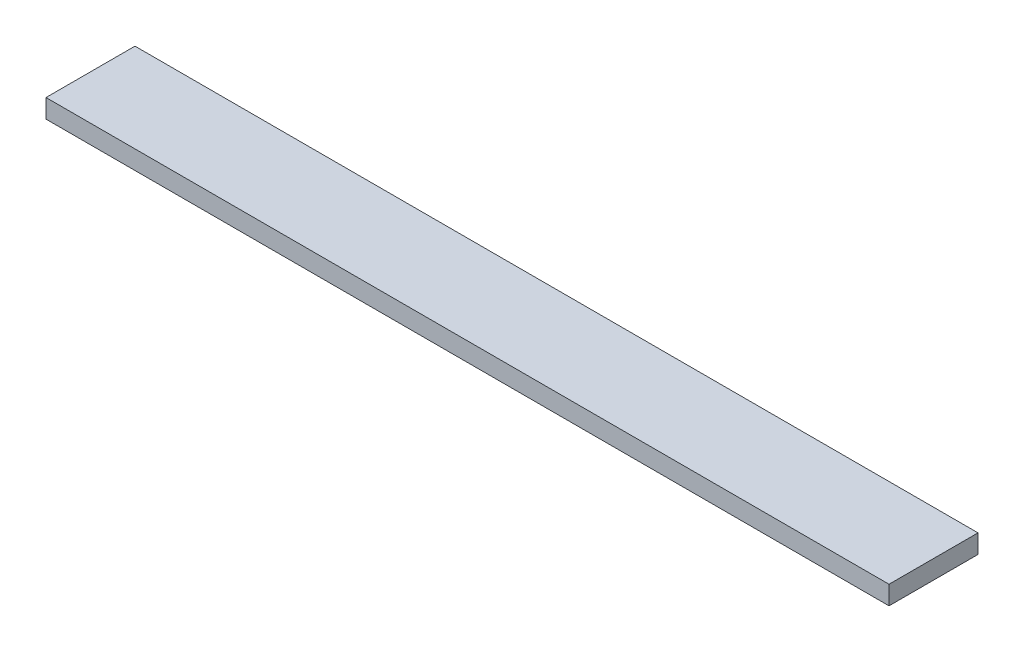
ISO-10303-21;
HEADER;
FILE_DESCRIPTION(('STEP AP214'),'2;1');
FILE_NAME('part.step','',(''),(''),'','','');
FILE_SCHEMA(('AUTOMOTIVE_DESIGN { 1 0 10303 214 1 1 1 1 }'));
ENDSEC;
DATA;
#1=APPLICATION_CONTEXT('core data for automotive mechanical design processes');
#2=APPLICATION_PROTOCOL_DEFINITION('international standard','automotive_design',2000,#1);
#3=PRODUCT_CONTEXT('',#1,'mechanical');
#4=PRODUCT('Part','Part','',(#3));
#5=PRODUCT_RELATED_PRODUCT_CATEGORY('part','',(#4));
#6=PRODUCT_DEFINITION_FORMATION('','',#4);
#7=PRODUCT_DEFINITION_CONTEXT('part definition',#1,'design');
#8=PRODUCT_DEFINITION('design','',#6,#7);
#9=PRODUCT_DEFINITION_SHAPE('','',#8);
#10=(LENGTH_UNIT() NAMED_UNIT(*) SI_UNIT(.MILLI.,.METRE.));
#11=(NAMED_UNIT(*) PLANE_ANGLE_UNIT() SI_UNIT($,.RADIAN.));
#12=(NAMED_UNIT(*) SI_UNIT($,.STERADIAN.) SOLID_ANGLE_UNIT());
#13=UNCERTAINTY_MEASURE_WITH_UNIT(LENGTH_MEASURE(1.E-05),#10,'distance_accuracy_value','');
#14=(GEOMETRIC_REPRESENTATION_CONTEXT(3) GLOBAL_UNCERTAINTY_ASSIGNED_CONTEXT((#13)) GLOBAL_UNIT_ASSIGNED_CONTEXT((#10,
#11,#12)) REPRESENTATION_CONTEXT('',''));
#15=CARTESIAN_POINT('',(0.,0.,0.));
#16=DIRECTION('',(0.,0.,1.));
#17=DIRECTION('',(1.,0.,0.));
#18=AXIS2_PLACEMENT_3D('',#15,#16,#17);
#19=CARTESIAN_POINT('',(0.,2.54,0.));
#20=DIRECTION('',(1.,0.,0.));
#21=DIRECTION('',(0.,0.,-1.));
#22=AXIS2_PLACEMENT_3D('',#19,#20,#21);
#23=PLANE('',#22);
#24=DIRECTION('',(0.,0.,1.));
#25=VECTOR('',#24,1.);
#26=CARTESIAN_POINT('',(0.,0.,0.));
#27=LINE('',#26,#25);
#28=CARTESIAN_POINT('',(0.,0.,-12.065));
#29=VERTEX_POINT('',#28);
#30=CARTESIAN_POINT('',(0.,0.,0.));
#31=VERTEX_POINT('',#30);
#32=EDGE_CURVE('E107',#29,#31,#27,.T.);
#33=ORIENTED_EDGE('',*,*,#32,.T.);
#34=DIRECTION('',(0.,-1.,0.));
#35=VECTOR('',#34,1.);
#36=CARTESIAN_POINT('',(0.,2.54,0.));
#37=LINE('',#36,#35);
#38=CARTESIAN_POINT('',(0.,2.54,0.));
#39=VERTEX_POINT('',#38);
#40=EDGE_CURVE('E11',#39,#31,#37,.T.);
#41=ORIENTED_EDGE('',*,*,#40,.F.);
#42=DIRECTION('',(0.,0.,1.));
#43=VECTOR('',#42,1.);
#44=CARTESIAN_POINT('',(0.,2.54,0.));
#45=LINE('',#44,#43);
#46=CARTESIAN_POINT('',(0.,2.54,-12.065));
#47=VERTEX_POINT('',#46);
#48=EDGE_CURVE('E91',#47,#39,#45,.T.);
#49=ORIENTED_EDGE('',*,*,#48,.F.);
#50=DIRECTION('',(0.,-1.,0.));
#51=VECTOR('',#50,1.);
#52=CARTESIAN_POINT('',(0.,2.54,-12.065));
#53=LINE('',#52,#51);
#54=EDGE_CURVE('E103',#47,#29,#53,.T.);
#55=ORIENTED_EDGE('',*,*,#54,.T.);
#56=EDGE_LOOP('',(#33,#41,#49,#55));
#57=FACE_BOUND('',#56,.T.);
#58=ADVANCED_FACE('F39',(#57),#23,.F.);
#59=CARTESIAN_POINT('',(0.,2.54,0.));
#60=DIRECTION('',(0.,0.,-1.));
#61=DIRECTION('',(-1.,0.,0.));
#62=AXIS2_PLACEMENT_3D('',#59,#60,#61);
#63=PLANE('',#62);
#64=DIRECTION('',(1.,0.,0.));
#65=VECTOR('',#64,1.);
#66=CARTESIAN_POINT('',(0.,0.,0.));
#67=LINE('',#66,#65);
#68=CARTESIAN_POINT('',(114.3,0.,0.));
#69=VERTEX_POINT('',#68);
#70=EDGE_CURVE('E96',#31,#69,#67,.T.);
#71=ORIENTED_EDGE('',*,*,#70,.T.);
#72=DIRECTION('',(0.,-1.,0.));
#73=VECTOR('',#72,1.);
#74=CARTESIAN_POINT('',(114.3,2.54,0.));
#75=LINE('',#74,#73);
#76=CARTESIAN_POINT('',(114.3,2.54,0.));
#77=VERTEX_POINT('',#76);
#78=EDGE_CURVE('E48',#77,#69,#75,.T.);
#79=ORIENTED_EDGE('',*,*,#78,.F.);
#80=DIRECTION('',(1.,0.,0.));
#81=VECTOR('',#80,1.);
#82=CARTESIAN_POINT('',(0.,2.54,0.));
#83=LINE('',#82,#81);
#84=EDGE_CURVE('E86',#39,#77,#83,.T.);
#85=ORIENTED_EDGE('',*,*,#84,.F.);
#86=ORIENTED_EDGE('',*,*,#40,.T.);
#87=EDGE_LOOP('',(#71,#79,#85,#86));
#88=FACE_BOUND('',#87,.T.);
#89=ADVANCED_FACE('F95',(#88),#63,.F.);
#90=CARTESIAN_POINT('',(114.3,2.54,0.));
#91=DIRECTION('',(-1.,0.,0.));
#92=DIRECTION('',(0.,0.,1.));
#93=AXIS2_PLACEMENT_3D('',#90,#91,#92);
#94=PLANE('',#93);
#95=DIRECTION('',(0.,0.,-1.));
#96=VECTOR('',#95,1.);
#97=CARTESIAN_POINT('',(114.3,0.,0.));
#98=LINE('',#97,#96);
#99=CARTESIAN_POINT('',(114.3,0.,-12.065));
#100=VERTEX_POINT('',#99);
#101=EDGE_CURVE('E73',#69,#100,#98,.T.);
#102=ORIENTED_EDGE('',*,*,#101,.T.);
#103=DIRECTION('',(0.,-1.,0.));
#104=VECTOR('',#103,1.);
#105=CARTESIAN_POINT('',(114.3,2.54,-12.065));
#106=LINE('',#105,#104);
#107=CARTESIAN_POINT('',(114.3,2.54,-12.065));
#108=VERTEX_POINT('',#107);
#109=EDGE_CURVE('E98',#108,#100,#106,.T.);
#110=ORIENTED_EDGE('',*,*,#109,.F.);
#111=DIRECTION('',(0.,0.,-1.));
#112=VECTOR('',#111,1.);
#113=CARTESIAN_POINT('',(114.3,2.54,0.));
#114=LINE('',#113,#112);
#115=EDGE_CURVE('E89',#77,#108,#114,.T.);
#116=ORIENTED_EDGE('',*,*,#115,.F.);
#117=ORIENTED_EDGE('',*,*,#78,.T.);
#118=EDGE_LOOP('',(#102,#110,#116,#117));
#119=FACE_BOUND('',#118,.T.);
#120=ADVANCED_FACE('F99',(#119),#94,.F.);
#121=CARTESIAN_POINT('',(0.,2.54,-12.065));
#122=DIRECTION('',(0.,0.,1.));
#123=DIRECTION('',(1.,0.,0.));
#124=AXIS2_PLACEMENT_3D('',#121,#122,#123);
#125=PLANE('',#124);
#126=DIRECTION('',(-1.,0.,0.));
#127=VECTOR('',#126,1.);
#128=CARTESIAN_POINT('',(0.,0.,-12.065));
#129=LINE('',#128,#127);
#130=EDGE_CURVE('E79',#100,#29,#129,.T.);
#131=ORIENTED_EDGE('',*,*,#130,.T.);
#132=ORIENTED_EDGE('',*,*,#54,.F.);
#133=DIRECTION('',(-1.,0.,0.));
#134=VECTOR('',#133,1.);
#135=CARTESIAN_POINT('',(0.,2.54,-12.065));
#136=LINE('',#135,#134);
#137=EDGE_CURVE('E56',#108,#47,#136,.T.);
#138=ORIENTED_EDGE('',*,*,#137,.F.);
#139=ORIENTED_EDGE('',*,*,#109,.T.);
#140=EDGE_LOOP('',(#131,#132,#138,#139));
#141=FACE_BOUND('',#140,.T.);
#142=ADVANCED_FACE('F120',(#141),#125,.F.);
#143=CARTESIAN_POINT('',(0.,2.54,0.));
#144=DIRECTION('',(0.,-1.,0.));
#145=DIRECTION('',(0.,0.,-1.));
#146=AXIS2_PLACEMENT_3D('',#143,#144,#145);
#147=PLANE('',#146);
#148=ORIENTED_EDGE('',*,*,#48,.T.);
#149=ORIENTED_EDGE('',*,*,#84,.T.);
#150=ORIENTED_EDGE('',*,*,#115,.T.);
#151=ORIENTED_EDGE('',*,*,#137,.T.);
#152=EDGE_LOOP('',(#148,#149,#150,#151));
#153=FACE_BOUND('',#152,.T.);
#154=ADVANCED_FACE('F87',(#153),#147,.F.);
#155=CARTESIAN_POINT('',(0.,0.,0.));
#156=DIRECTION('',(0.,-1.,0.));
#157=DIRECTION('',(0.,0.,-1.));
#158=AXIS2_PLACEMENT_3D('',#155,#156,#157);
#159=PLANE('',#158);
#160=ORIENTED_EDGE('',*,*,#32,.F.);
#161=ORIENTED_EDGE('',*,*,#130,.F.);
#162=ORIENTED_EDGE('',*,*,#101,.F.);
#163=ORIENTED_EDGE('',*,*,#70,.F.);
#164=EDGE_LOOP('',(#160,#161,#162,#163));
#165=FACE_BOUND('',#164,.T.);
#166=ADVANCED_FACE('F123',(#165),#159,.T.);
#167=CLOSED_SHELL('',(#58,#89,#120,#142,#154,#166));
#168=MANIFOLD_SOLID_BREP('B2',#167);
#169=ADVANCED_BREP_SHAPE_REPRESENTATION('',(#18,#168),#14);
#170=SHAPE_DEFINITION_REPRESENTATION(#9,#169);
ENDSEC;
END-ISO-10303-21;
